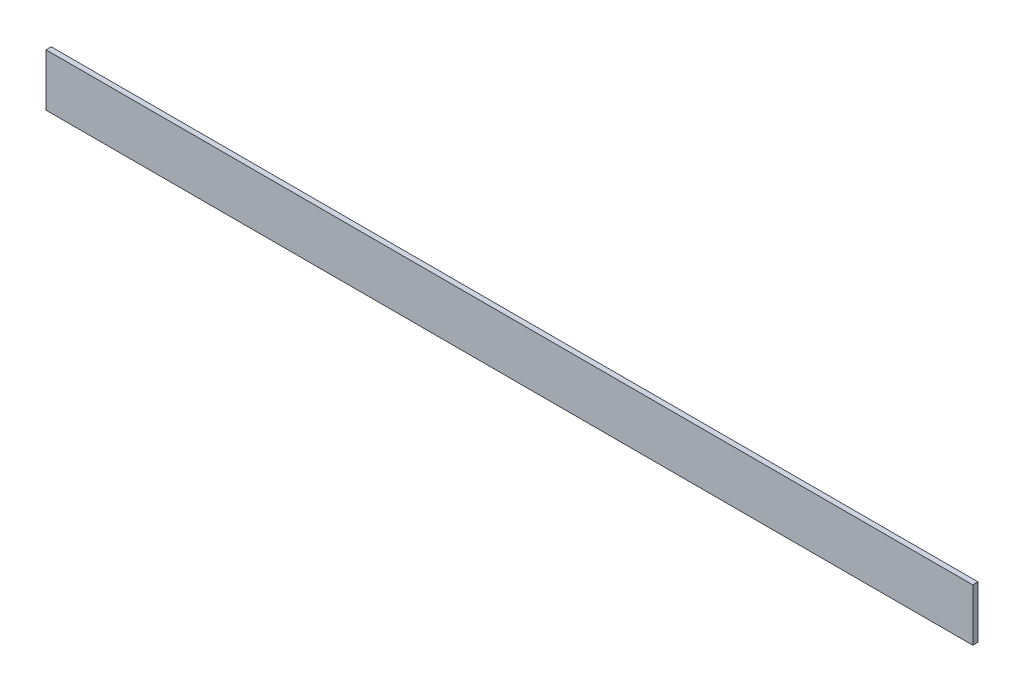
ISO-10303-21;
HEADER;
FILE_DESCRIPTION(('STEP AP214'),'2;1');
FILE_NAME('part.step','',(''),(''),'','','');
FILE_SCHEMA(('AUTOMOTIVE_DESIGN { 1 0 10303 214 1 1 1 1 }'));
ENDSEC;
DATA;
#1=APPLICATION_CONTEXT('core data for automotive mechanical design processes');
#2=APPLICATION_PROTOCOL_DEFINITION('international standard','automotive_design',2000,#1);
#3=PRODUCT_CONTEXT('',#1,'mechanical');
#4=PRODUCT('Part','Part','',(#3));
#5=PRODUCT_RELATED_PRODUCT_CATEGORY('part','',(#4));
#6=PRODUCT_DEFINITION_FORMATION('','',#4);
#7=PRODUCT_DEFINITION_CONTEXT('part definition',#1,'design');
#8=PRODUCT_DEFINITION('design','',#6,#7);
#9=PRODUCT_DEFINITION_SHAPE('','',#8);
#10=(LENGTH_UNIT() NAMED_UNIT(*) SI_UNIT(.MILLI.,.METRE.));
#11=(NAMED_UNIT(*) PLANE_ANGLE_UNIT() SI_UNIT($,.RADIAN.));
#12=(NAMED_UNIT(*) SI_UNIT($,.STERADIAN.) SOLID_ANGLE_UNIT());
#13=UNCERTAINTY_MEASURE_WITH_UNIT(LENGTH_MEASURE(1.E-05),#10,'distance_accuracy_value','');
#14=(GEOMETRIC_REPRESENTATION_CONTEXT(3) GLOBAL_UNCERTAINTY_ASSIGNED_CONTEXT((#13)) GLOBAL_UNIT_ASSIGNED_CONTEXT((#10,
#11,#12)) REPRESENTATION_CONTEXT('',''));
#15=CARTESIAN_POINT('',(0.,0.,0.));
#16=DIRECTION('',(0.,0.,1.));
#17=DIRECTION('',(1.,0.,0.));
#18=AXIS2_PLACEMENT_3D('',#15,#16,#17);
#19=CARTESIAN_POINT('',(-177.,5.27896215972079,2.));
#20=DIRECTION('',(1.,0.,0.));
#21=DIRECTION('',(0.,0.,-1.));
#22=AXIS2_PLACEMENT_3D('',#19,#20,#21);
#23=PLANE('',#22);
#24=DIRECTION('',(0.,-1.,0.));
#25=VECTOR('',#24,1.);
#26=CARTESIAN_POINT('',(-177.,5.27896215972079,0.));
#27=LINE('',#26,#25);
#28=CARTESIAN_POINT('',(-177.,5.27896215972079,0.));
#29=VERTEX_POINT('',#28);
#30=CARTESIAN_POINT('',(-177.,-14.7210378402792,0.));
#31=VERTEX_POINT('',#30);
#32=EDGE_CURVE('E98',#29,#31,#27,.T.);
#33=ORIENTED_EDGE('',*,*,#32,.T.);
#34=DIRECTION('',(0.,0.,-1.));
#35=VECTOR('',#34,1.);
#36=CARTESIAN_POINT('',(-177.,-14.7210378402792,2.));
#37=LINE('',#36,#35);
#38=CARTESIAN_POINT('',(-177.,-14.7210378402792,2.));
#39=VERTEX_POINT('',#38);
#40=EDGE_CURVE('E11',#39,#31,#37,.T.);
#41=ORIENTED_EDGE('',*,*,#40,.F.);
#42=DIRECTION('',(0.,-1.,0.));
#43=VECTOR('',#42,1.);
#44=CARTESIAN_POINT('',(-177.,5.27896215972079,2.));
#45=LINE('',#44,#43);
#46=CARTESIAN_POINT('',(-177.,5.27896215972079,2.));
#47=VERTEX_POINT('',#46);
#48=EDGE_CURVE('E86',#47,#39,#45,.T.);
#49=ORIENTED_EDGE('',*,*,#48,.F.);
#50=DIRECTION('',(0.,0.,-1.));
#51=VECTOR('',#50,1.);
#52=CARTESIAN_POINT('',(-177.,5.27896215972079,2.));
#53=LINE('',#52,#51);
#54=EDGE_CURVE('E94',#47,#29,#53,.T.);
#55=ORIENTED_EDGE('',*,*,#54,.T.);
#56=EDGE_LOOP('',(#33,#41,#49,#55));
#57=FACE_BOUND('',#56,.T.);
#58=ADVANCED_FACE('F35',(#57),#23,.F.);
#59=CARTESIAN_POINT('',(-177.,-14.7210378402792,2.));
#60=DIRECTION('',(0.,1.,0.));
#61=DIRECTION('',(0.,0.,1.));
#62=AXIS2_PLACEMENT_3D('',#59,#60,#61);
#63=PLANE('',#62);
#64=DIRECTION('',(1.,0.,0.));
#65=VECTOR('',#64,1.);
#66=CARTESIAN_POINT('',(-177.,-14.7210378402792,0.));
#67=LINE('',#66,#65);
#68=CARTESIAN_POINT('',(177.485,-14.7210378402792,0.));
#69=VERTEX_POINT('',#68);
#70=EDGE_CURVE('E90',#31,#69,#67,.T.);
#71=ORIENTED_EDGE('',*,*,#70,.T.);
#72=DIRECTION('',(0.,0.,-1.));
#73=VECTOR('',#72,1.);
#74=CARTESIAN_POINT('',(177.485,-14.7210378402792,2.));
#75=LINE('',#74,#73);
#76=CARTESIAN_POINT('',(177.485,-14.7210378402792,2.));
#77=VERTEX_POINT('',#76);
#78=EDGE_CURVE('E43',#77,#69,#75,.T.);
#79=ORIENTED_EDGE('',*,*,#78,.F.);
#80=DIRECTION('',(1.,0.,0.));
#81=VECTOR('',#80,1.);
#82=CARTESIAN_POINT('',(-177.,-14.7210378402792,2.));
#83=LINE('',#82,#81);
#84=EDGE_CURVE('E81',#39,#77,#83,.T.);
#85=ORIENTED_EDGE('',*,*,#84,.F.);
#86=ORIENTED_EDGE('',*,*,#40,.T.);
#87=EDGE_LOOP('',(#71,#79,#85,#86));
#88=FACE_BOUND('',#87,.T.);
#89=ADVANCED_FACE('F89',(#88),#63,.F.);
#90=CARTESIAN_POINT('',(177.485,5.27896215972079,2.));
#91=DIRECTION('',(-1.,0.,0.));
#92=DIRECTION('',(0.,0.,1.));
#93=AXIS2_PLACEMENT_3D('',#90,#91,#92);
#94=PLANE('',#93);
#95=DIRECTION('',(0.,1.,0.));
#96=VECTOR('',#95,1.);
#97=CARTESIAN_POINT('',(177.485,5.27896215972079,0.));
#98=LINE('',#97,#96);
#99=CARTESIAN_POINT('',(177.485,5.27896215972079,0.));
#100=VERTEX_POINT('',#99);
#101=EDGE_CURVE('E68',#69,#100,#98,.T.);
#102=ORIENTED_EDGE('',*,*,#101,.T.);
#103=DIRECTION('',(0.,0.,-1.));
#104=VECTOR('',#103,1.);
#105=CARTESIAN_POINT('',(177.485,5.27896215972079,2.));
#106=LINE('',#105,#104);
#107=CARTESIAN_POINT('',(177.485,5.27896215972079,2.));
#108=VERTEX_POINT('',#107);
#109=EDGE_CURVE('E91',#108,#100,#106,.T.);
#110=ORIENTED_EDGE('',*,*,#109,.F.);
#111=DIRECTION('',(0.,1.,0.));
#112=VECTOR('',#111,1.);
#113=CARTESIAN_POINT('',(177.485,5.27896215972079,2.));
#114=LINE('',#113,#112);
#115=EDGE_CURVE('E84',#77,#108,#114,.T.);
#116=ORIENTED_EDGE('',*,*,#115,.F.);
#117=ORIENTED_EDGE('',*,*,#78,.T.);
#118=EDGE_LOOP('',(#102,#110,#116,#117));
#119=FACE_BOUND('',#118,.T.);
#120=ADVANCED_FACE('F92',(#119),#94,.F.);
#121=CARTESIAN_POINT('',(-177.,5.27896215972079,2.));
#122=DIRECTION('',(0.,-1.,0.));
#123=DIRECTION('',(0.,0.,-1.));
#124=AXIS2_PLACEMENT_3D('',#121,#122,#123);
#125=PLANE('',#124);
#126=DIRECTION('',(-1.,0.,0.));
#127=VECTOR('',#126,1.);
#128=CARTESIAN_POINT('',(-177.,5.27896215972079,0.));
#129=LINE('',#128,#127);
#130=EDGE_CURVE('E74',#100,#29,#129,.T.);
#131=ORIENTED_EDGE('',*,*,#130,.T.);
#132=ORIENTED_EDGE('',*,*,#54,.F.);
#133=DIRECTION('',(-1.,0.,0.));
#134=VECTOR('',#133,1.);
#135=CARTESIAN_POINT('',(-177.,5.27896215972079,2.));
#136=LINE('',#135,#134);
#137=EDGE_CURVE('E51',#108,#47,#136,.T.);
#138=ORIENTED_EDGE('',*,*,#137,.F.);
#139=ORIENTED_EDGE('',*,*,#109,.T.);
#140=EDGE_LOOP('',(#131,#132,#138,#139));
#141=FACE_BOUND('',#140,.T.);
#142=ADVANCED_FACE('F105',(#141),#125,.F.);
#143=CARTESIAN_POINT('',(0.,0.,2.));
#144=DIRECTION('',(0.,0.,1.));
#145=DIRECTION('',(1.,0.,0.));
#146=AXIS2_PLACEMENT_3D('',#143,#144,#145);
#147=PLANE('',#146);
#148=ORIENTED_EDGE('',*,*,#48,.T.);
#149=ORIENTED_EDGE('',*,*,#84,.T.);
#150=ORIENTED_EDGE('',*,*,#115,.T.);
#151=ORIENTED_EDGE('',*,*,#137,.T.);
#152=EDGE_LOOP('',(#148,#149,#150,#151));
#153=FACE_BOUND('',#152,.T.);
#154=ADVANCED_FACE('F82',(#153),#147,.T.);
#155=CARTESIAN_POINT('',(0.,0.,0.));
#156=DIRECTION('',(0.,0.,1.));
#157=DIRECTION('',(1.,0.,0.));
#158=AXIS2_PLACEMENT_3D('',#155,#156,#157);
#159=PLANE('',#158);
#160=ORIENTED_EDGE('',*,*,#32,.F.);
#161=ORIENTED_EDGE('',*,*,#130,.F.);
#162=ORIENTED_EDGE('',*,*,#101,.F.);
#163=ORIENTED_EDGE('',*,*,#70,.F.);
#164=EDGE_LOOP('',(#160,#161,#162,#163));
#165=FACE_BOUND('',#164,.T.);
#166=ADVANCED_FACE('F108',(#165),#159,.F.);
#167=CLOSED_SHELL('',(#58,#89,#120,#142,#154,#166));
#168=MANIFOLD_SOLID_BREP('B2',#167);
#169=ADVANCED_BREP_SHAPE_REPRESENTATION('',(#18,#168),#14);
#170=SHAPE_DEFINITION_REPRESENTATION(#9,#169);
ENDSEC;
END-ISO-10303-21;
